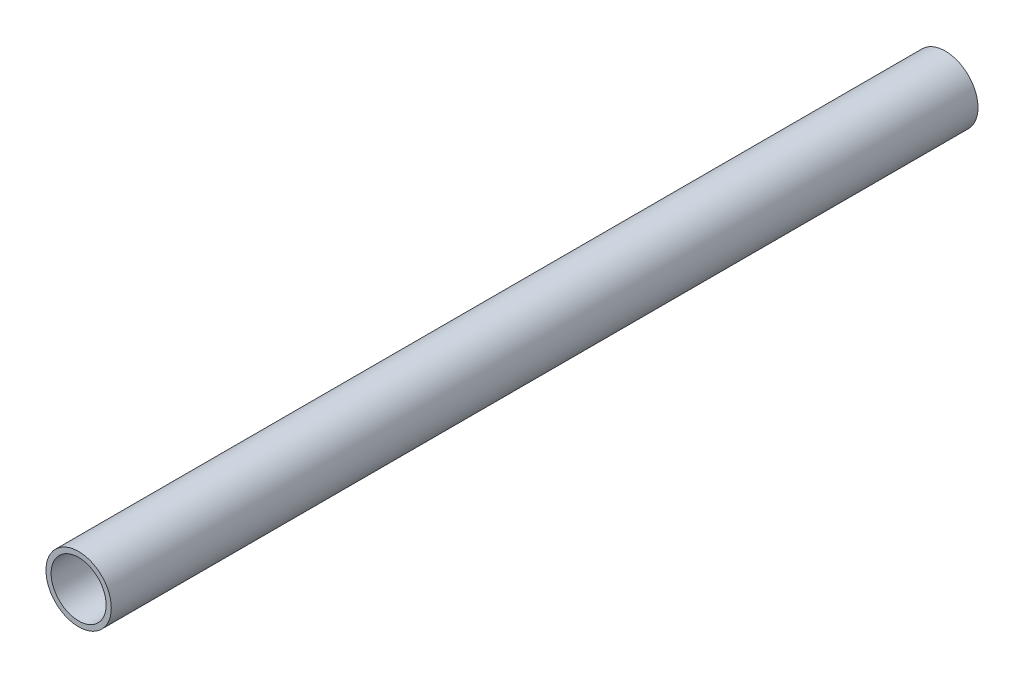
ISO-10303-21;
HEADER;
FILE_DESCRIPTION(('STEP AP214'),'2;1');
FILE_NAME('part.step','',(''),(''),'','','');
FILE_SCHEMA(('AUTOMOTIVE_DESIGN { 1 0 10303 214 1 1 1 1 }'));
ENDSEC;
DATA;
#1=APPLICATION_CONTEXT('core data for automotive mechanical design processes');
#2=APPLICATION_PROTOCOL_DEFINITION('international standard','automotive_design',2000,#1);
#3=PRODUCT_CONTEXT('',#1,'mechanical');
#4=PRODUCT('Part','Part','',(#3));
#5=PRODUCT_RELATED_PRODUCT_CATEGORY('part','',(#4));
#6=PRODUCT_DEFINITION_FORMATION('','',#4);
#7=PRODUCT_DEFINITION_CONTEXT('part definition',#1,'design');
#8=PRODUCT_DEFINITION('design','',#6,#7);
#9=PRODUCT_DEFINITION_SHAPE('','',#8);
#10=(LENGTH_UNIT() NAMED_UNIT(*) SI_UNIT(.MILLI.,.METRE.));
#11=(NAMED_UNIT(*) PLANE_ANGLE_UNIT() SI_UNIT($,.RADIAN.));
#12=(NAMED_UNIT(*) SI_UNIT($,.STERADIAN.) SOLID_ANGLE_UNIT());
#13=UNCERTAINTY_MEASURE_WITH_UNIT(LENGTH_MEASURE(1.E-05),#10,'distance_accuracy_value','');
#14=(GEOMETRIC_REPRESENTATION_CONTEXT(3) GLOBAL_UNCERTAINTY_ASSIGNED_CONTEXT((#13)) GLOBAL_UNIT_ASSIGNED_CONTEXT((#10,
#11,#12)) REPRESENTATION_CONTEXT('',''));
#15=CARTESIAN_POINT('',(0.,0.,0.));
#16=DIRECTION('',(0.,0.,1.));
#17=DIRECTION('',(1.,0.,0.));
#18=AXIS2_PLACEMENT_3D('',#15,#16,#17);
#19=CARTESIAN_POINT('',(0.,0.,252.));
#20=DIRECTION('',(0.,0.,1.));
#21=DIRECTION('',(1.,0.,0.));
#22=AXIS2_PLACEMENT_3D('',#19,#20,#21);
#23=PLANE('',#22);
#24=CARTESIAN_POINT('',(0.,0.,252.));
#25=DIRECTION('',(0.,0.,1.));
#26=DIRECTION('',(1.,0.,0.));
#27=AXIS2_PLACEMENT_3D('',#24,#25,#26);
#28=CIRCLE('',#27,9.5);
#29=CARTESIAN_POINT('',(9.5,0.,252.));
#30=VERTEX_POINT('',#29);
#31=EDGE_CURVE('E10',#30,#30,#28,.T.);
#32=ORIENTED_EDGE('',*,*,#31,.T.);
#33=EDGE_LOOP('',(#32));
#34=FACE_BOUND('',#33,.T.);
#35=CARTESIAN_POINT('',(0.,0.,252.));
#36=DIRECTION('',(0.,0.,1.));
#37=DIRECTION('',(1.,0.,0.));
#38=AXIS2_PLACEMENT_3D('',#35,#36,#37);
#39=CIRCLE('',#38,8.);
#40=CARTESIAN_POINT('',(8.,0.,252.));
#41=VERTEX_POINT('',#40);
#42=EDGE_CURVE('E44',#41,#41,#39,.T.);
#43=ORIENTED_EDGE('',*,*,#42,.F.);
#44=EDGE_LOOP('',(#43));
#45=FACE_BOUND('',#44,.T.);
#46=ADVANCED_FACE('F33',(#34,#45),#23,.T.);
#47=CARTESIAN_POINT('',(0.,0.,0.));
#48=DIRECTION('',(0.,0.,1.));
#49=DIRECTION('',(1.,0.,0.));
#50=AXIS2_PLACEMENT_3D('',#47,#48,#49);
#51=PLANE('',#50);
#52=CARTESIAN_POINT('',(0.,0.,0.));
#53=DIRECTION('',(0.,0.,1.));
#54=DIRECTION('',(1.,0.,0.));
#55=AXIS2_PLACEMENT_3D('',#52,#53,#54);
#56=CIRCLE('',#55,9.5);
#57=CARTESIAN_POINT('',(9.5,0.,0.));
#58=VERTEX_POINT('',#57);
#59=EDGE_CURVE('E37',#58,#58,#56,.T.);
#60=ORIENTED_EDGE('',*,*,#59,.F.);
#61=EDGE_LOOP('',(#60));
#62=FACE_BOUND('',#61,.T.);
#63=CARTESIAN_POINT('',(0.,0.,0.));
#64=DIRECTION('',(0.,0.,1.));
#65=DIRECTION('',(1.,0.,0.));
#66=AXIS2_PLACEMENT_3D('',#63,#64,#65);
#67=CIRCLE('',#66,8.);
#68=CARTESIAN_POINT('',(8.,0.,0.));
#69=VERTEX_POINT('',#68);
#70=EDGE_CURVE('E46',#69,#69,#67,.T.);
#71=ORIENTED_EDGE('',*,*,#70,.T.);
#72=EDGE_LOOP('',(#71));
#73=FACE_BOUND('',#72,.T.);
#74=ADVANCED_FACE('F56',(#62,#73),#51,.F.);
#75=CARTESIAN_POINT('',(0.,0.,252.));
#76=DIRECTION('',(0.,0.,-1.));
#77=DIRECTION('',(-1.,0.,0.));
#78=AXIS2_PLACEMENT_3D('',#75,#76,#77);
#79=CYLINDRICAL_SURFACE('',#78,9.5);
#80=ORIENTED_EDGE('',*,*,#31,.F.);
#81=EDGE_LOOP('',(#80));
#82=FACE_BOUND('',#81,.T.);
#83=ORIENTED_EDGE('',*,*,#59,.T.);
#84=EDGE_LOOP('',(#83));
#85=FACE_BOUND('',#84,.T.);
#86=ADVANCED_FACE('F35',(#82,#85),#79,.T.);
#87=CARTESIAN_POINT('',(0.,0.,252.));
#88=DIRECTION('',(0.,0.,-1.));
#89=DIRECTION('',(-1.,0.,0.));
#90=AXIS2_PLACEMENT_3D('',#87,#88,#89);
#91=CYLINDRICAL_SURFACE('',#90,8.);
#92=ORIENTED_EDGE('',*,*,#42,.T.);
#93=EDGE_LOOP('',(#92));
#94=FACE_BOUND('',#93,.T.);
#95=ORIENTED_EDGE('',*,*,#70,.F.);
#96=EDGE_LOOP('',(#95));
#97=FACE_BOUND('',#96,.T.);
#98=ADVANCED_FACE('F52',(#94,#97),#91,.F.);
#99=CLOSED_SHELL('',(#46,#74,#86,#98));
#100=MANIFOLD_SOLID_BREP('B2',#99);
#101=ADVANCED_BREP_SHAPE_REPRESENTATION('',(#18,#100),#14);
#102=SHAPE_DEFINITION_REPRESENTATION(#9,#101);
ENDSEC;
END-ISO-10303-21;
